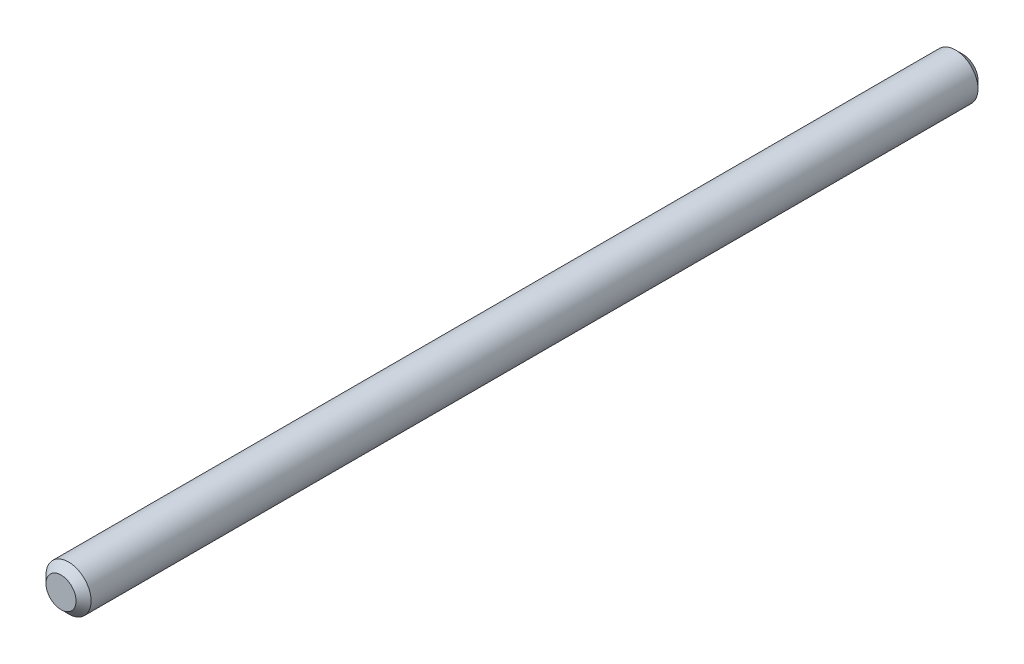
ISO-10303-21;
HEADER;
FILE_DESCRIPTION(('STEP AP214'),'2;1');
FILE_NAME('part.step','',(''),(''),'','','');
FILE_SCHEMA(('AUTOMOTIVE_DESIGN { 1 0 10303 214 1 1 1 1 }'));
ENDSEC;
DATA;
#1=APPLICATION_CONTEXT('core data for automotive mechanical design processes');
#2=APPLICATION_PROTOCOL_DEFINITION('international standard','automotive_design',2000,#1);
#3=PRODUCT_CONTEXT('',#1,'mechanical');
#4=PRODUCT('Part','Part','',(#3));
#5=PRODUCT_RELATED_PRODUCT_CATEGORY('part','',(#4));
#6=PRODUCT_DEFINITION_FORMATION('','',#4);
#7=PRODUCT_DEFINITION_CONTEXT('part definition',#1,'design');
#8=PRODUCT_DEFINITION('design','',#6,#7);
#9=PRODUCT_DEFINITION_SHAPE('','',#8);
#10=(LENGTH_UNIT() NAMED_UNIT(*) SI_UNIT(.MILLI.,.METRE.));
#11=(NAMED_UNIT(*) PLANE_ANGLE_UNIT() SI_UNIT($,.RADIAN.));
#12=(NAMED_UNIT(*) SI_UNIT($,.STERADIAN.) SOLID_ANGLE_UNIT());
#13=UNCERTAINTY_MEASURE_WITH_UNIT(LENGTH_MEASURE(1.E-05),#10,'distance_accuracy_value','');
#14=(GEOMETRIC_REPRESENTATION_CONTEXT(3) GLOBAL_UNCERTAINTY_ASSIGNED_CONTEXT((#13)) GLOBAL_UNIT_ASSIGNED_CONTEXT((#10,
#11,#12)) REPRESENTATION_CONTEXT('',''));
#15=CARTESIAN_POINT('',(0.,0.,0.));
#16=DIRECTION('',(0.,0.,1.));
#17=DIRECTION('',(1.,0.,0.));
#18=AXIS2_PLACEMENT_3D('',#15,#16,#17);
#19=CARTESIAN_POINT('',(0.,0.,60.));
#20=DIRECTION('',(0.,0.,-1.));
#21=DIRECTION('',(-1.,0.,0.));
#22=AXIS2_PLACEMENT_3D('',#19,#20,#21);
#23=CYLINDRICAL_SURFACE('',#22,1.5);
#24=CARTESIAN_POINT('',(0.,0.,0.499999999999994));
#25=DIRECTION('',(0.,0.,1.));
#26=DIRECTION('',(1.,0.,0.));
#27=AXIS2_PLACEMENT_3D('',#24,#25,#26);
#28=CIRCLE('',#27,1.5);
#29=CARTESIAN_POINT('',(1.5,0.,0.499999999999994));
#30=VERTEX_POINT('',#29);
#31=EDGE_CURVE('E34',#30,#30,#28,.T.);
#32=ORIENTED_EDGE('',*,*,#31,.T.);
#33=EDGE_LOOP('',(#32));
#34=FACE_BOUND('',#33,.T.);
#35=CARTESIAN_POINT('',(0.,0.,59.5));
#36=DIRECTION('',(0.,0.,1.));
#37=DIRECTION('',(1.,0.,0.));
#38=AXIS2_PLACEMENT_3D('',#35,#36,#37);
#39=CIRCLE('',#38,1.5);
#40=CARTESIAN_POINT('',(1.5,0.,59.5));
#41=VERTEX_POINT('',#40);
#42=EDGE_CURVE('E38',#41,#41,#39,.F.);
#43=ORIENTED_EDGE('',*,*,#42,.T.);
#44=EDGE_LOOP('',(#43));
#45=FACE_BOUND('',#44,.T.);
#46=ADVANCED_FACE('F24',(#34,#45),#23,.T.);
#47=CARTESIAN_POINT('',(0.,0.,60.));
#48=DIRECTION('',(0.,0.,1.));
#49=DIRECTION('',(1.,0.,0.));
#50=AXIS2_PLACEMENT_3D('',#47,#48,#49);
#51=PLANE('',#50);
#52=CARTESIAN_POINT('',(0.,0.,60.));
#53=DIRECTION('',(0.,0.,1.));
#54=DIRECTION('',(1.,0.,0.));
#55=AXIS2_PLACEMENT_3D('',#52,#53,#54);
#56=CIRCLE('',#55,1.);
#57=CARTESIAN_POINT('',(1.,0.,60.));
#58=VERTEX_POINT('',#57);
#59=EDGE_CURVE('E10',#58,#58,#56,.T.);
#60=ORIENTED_EDGE('',*,*,#59,.T.);
#61=EDGE_LOOP('',(#60));
#62=FACE_BOUND('',#61,.T.);
#63=ADVANCED_FACE('F57',(#62),#51,.T.);
#64=CARTESIAN_POINT('',(0.,0.,0.));
#65=DIRECTION('',(0.,0.,1.));
#66=DIRECTION('',(1.,0.,0.));
#67=AXIS2_PLACEMENT_3D('',#64,#65,#66);
#68=PLANE('',#67);
#69=CARTESIAN_POINT('',(0.,0.,0.));
#70=DIRECTION('',(0.,0.,1.));
#71=DIRECTION('',(1.,0.,0.));
#72=AXIS2_PLACEMENT_3D('',#69,#70,#71);
#73=CIRCLE('',#72,1.);
#74=CARTESIAN_POINT('',(1.,0.,0.));
#75=VERTEX_POINT('',#74);
#76=EDGE_CURVE('E30',#75,#75,#73,.F.);
#77=ORIENTED_EDGE('',*,*,#76,.T.);
#78=EDGE_LOOP('',(#77));
#79=FACE_BOUND('',#78,.T.);
#80=ADVANCED_FACE('F53',(#79),#68,.F.);
#81=CARTESIAN_POINT('',(0.,0.,0.499999999999994));
#82=DIRECTION('',(0.,0.,1.));
#83=DIRECTION('',(1.,0.,0.));
#84=AXIS2_PLACEMENT_3D('',#81,#82,#83);
#85=CONICAL_SURFACE('',#84,1.5,0.785398163397453);
#86=ORIENTED_EDGE('',*,*,#76,.F.);
#87=EDGE_LOOP('',(#86));
#88=FACE_BOUND('',#87,.T.);
#89=ORIENTED_EDGE('',*,*,#31,.F.);
#90=EDGE_LOOP('',(#89));
#91=FACE_BOUND('',#90,.T.);
#92=ADVANCED_FACE('F48',(#88,#91),#85,.T.);
#93=CARTESIAN_POINT('',(0.,0.,60.));
#94=DIRECTION('',(0.,0.,-1.));
#95=DIRECTION('',(-1.,0.,0.));
#96=AXIS2_PLACEMENT_3D('',#93,#94,#95);
#97=CONICAL_SURFACE('',#96,1.,0.785398163397442);
#98=ORIENTED_EDGE('',*,*,#42,.F.);
#99=EDGE_LOOP('',(#98));
#100=FACE_BOUND('',#99,.T.);
#101=ORIENTED_EDGE('',*,*,#59,.F.);
#102=EDGE_LOOP('',(#101));
#103=FACE_BOUND('',#102,.T.);
#104=ADVANCED_FACE('F45',(#100,#103),#97,.T.);
#105=CLOSED_SHELL('',(#46,#63,#80,#92,#104));
#106=MANIFOLD_SOLID_BREP('B2',#105);
#107=ADVANCED_BREP_SHAPE_REPRESENTATION('',(#18,#106),#14);
#108=SHAPE_DEFINITION_REPRESENTATION(#9,#107);
ENDSEC;
END-ISO-10303-21;
